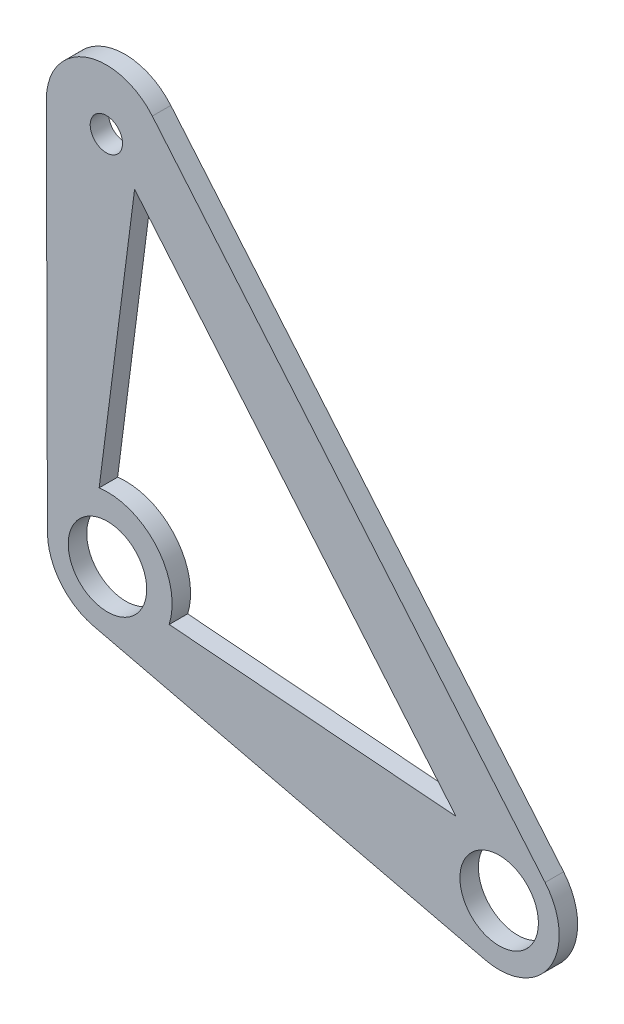
ISO-10303-21;
HEADER;
FILE_DESCRIPTION(('STEP AP214'),'2;1');
FILE_NAME('part.step','',(''),(''),'','','');
FILE_SCHEMA(('AUTOMOTIVE_DESIGN { 1 0 10303 214 1 1 1 1 }'));
ENDSEC;
DATA;
#1=APPLICATION_CONTEXT('core data for automotive mechanical design processes');
#2=APPLICATION_PROTOCOL_DEFINITION('international standard','automotive_design',2000,#1);
#3=PRODUCT_CONTEXT('',#1,'mechanical');
#4=PRODUCT('Part','Part','',(#3));
#5=PRODUCT_RELATED_PRODUCT_CATEGORY('part','',(#4));
#6=PRODUCT_DEFINITION_FORMATION('','',#4);
#7=PRODUCT_DEFINITION_CONTEXT('part definition',#1,'design');
#8=PRODUCT_DEFINITION('design','',#6,#7);
#9=PRODUCT_DEFINITION_SHAPE('','',#8);
#10=(LENGTH_UNIT() NAMED_UNIT(*) SI_UNIT(.MILLI.,.METRE.));
#11=(NAMED_UNIT(*) PLANE_ANGLE_UNIT() SI_UNIT($,.RADIAN.));
#12=(NAMED_UNIT(*) SI_UNIT($,.STERADIAN.) SOLID_ANGLE_UNIT());
#13=UNCERTAINTY_MEASURE_WITH_UNIT(LENGTH_MEASURE(1.E-05),#10,'distance_accuracy_value','');
#14=(GEOMETRIC_REPRESENTATION_CONTEXT(3) GLOBAL_UNCERTAINTY_ASSIGNED_CONTEXT((#13)) GLOBAL_UNIT_ASSIGNED_CONTEXT((#10,
#11,#12)) REPRESENTATION_CONTEXT('',''));
#15=CARTESIAN_POINT('',(0.,0.,0.));
#16=DIRECTION('',(0.,0.,1.));
#17=DIRECTION('',(1.,0.,0.));
#18=AXIS2_PLACEMENT_3D('',#15,#16,#17);
#19=CARTESIAN_POINT('',(-1.50556471431147,-6.32323294612971,2.));
#20=DIRECTION('',(0.231625340663302,0.97280506863534,0.));
#21=DIRECTION('',(-0.97280506863534,0.231625340663302,0.));
#22=AXIS2_PLACEMENT_3D('',#19,#20,#21);
#23=PLANE('',#22);
#24=DIRECTION('',(0.97280506863534,-0.231625340663302,0.));
#25=VECTOR('',#24,1.);
#26=CARTESIAN_POINT('',(-1.50556471431147,-6.32323294612971,0.));
#27=LINE('',#26,#25);
#28=CARTESIAN_POINT('',(-1.50556471431147,-6.32323294612971,0.));
#29=VERTEX_POINT('',#28);
#30=CARTESIAN_POINT('',(40.9087362781894,-16.4220977990497,0.));
#31=VERTEX_POINT('',#30);
#32=EDGE_CURVE('E143',#29,#31,#27,.T.);
#33=ORIENTED_EDGE('',*,*,#32,.T.);
#34=DIRECTION('',(0.,0.,-1.));
#35=VECTOR('',#34,1.);
#36=CARTESIAN_POINT('',(40.9087362781894,-16.4220977990497,2.));
#37=LINE('',#36,#35);
#38=CARTESIAN_POINT('',(40.9087362781894,-16.4220977990497,2.));
#39=VERTEX_POINT('',#38);
#40=EDGE_CURVE('E11',#39,#31,#37,.T.);
#41=ORIENTED_EDGE('',*,*,#40,.F.);
#42=DIRECTION('',(0.97280506863534,-0.231625340663302,0.));
#43=VECTOR('',#42,1.);
#44=CARTESIAN_POINT('',(-1.50556471431147,-6.32323294612971,2.));
#45=LINE('',#44,#43);
#46=CARTESIAN_POINT('',(-1.50556471431147,-6.32323294612971,2.));
#47=VERTEX_POINT('',#46);
#48=EDGE_CURVE('E164',#47,#39,#45,.T.);
#49=ORIENTED_EDGE('',*,*,#48,.F.);
#50=DIRECTION('',(0.,0.,-1.));
#51=VECTOR('',#50,1.);
#52=CARTESIAN_POINT('',(-1.50556471431147,-6.32323294612971,2.));
#53=LINE('',#52,#51);
#54=EDGE_CURVE('E197',#47,#29,#53,.T.);
#55=ORIENTED_EDGE('',*,*,#54,.T.);
#56=EDGE_LOOP('',(#33,#41,#49,#55));
#57=FACE_BOUND('',#56,.T.);
#58=ADVANCED_FACE('F41',(#57),#23,.F.);
#59=CARTESIAN_POINT('',(42.4143009925008,-10.09886485292,2.));
#60=DIRECTION('',(0.,0.,-1.));
#61=DIRECTION('',(-1.,0.,0.));
#62=AXIS2_PLACEMENT_3D('',#59,#60,#61);
#63=CYLINDRICAL_SURFACE('',#62,6.5);
#64=CARTESIAN_POINT('',(42.4143009925008,-10.09886485292,0.));
#65=DIRECTION('',(0.,0.,1.));
#66=DIRECTION('',(1.,0.,0.));
#67=AXIS2_PLACEMENT_3D('',#64,#65,#66);
#68=CIRCLE('',#67,6.5);
#69=CARTESIAN_POINT('',(47.3899667623732,-5.91643133324272,0.));
#70=VERTEX_POINT('',#69);
#71=EDGE_CURVE('E148',#31,#70,#68,.T.);
#72=ORIENTED_EDGE('',*,*,#71,.T.);
#73=DIRECTION('',(0.,0.,-1.));
#74=VECTOR('',#73,1.);
#75=CARTESIAN_POINT('',(47.3899667623732,-5.91643133324272,2.));
#76=LINE('',#75,#74);
#77=CARTESIAN_POINT('',(47.3899667623732,-5.91643133324272,2.));
#78=VERTEX_POINT('',#77);
#79=EDGE_CURVE('E49',#78,#70,#76,.T.);
#80=ORIENTED_EDGE('',*,*,#79,.F.);
#81=CARTESIAN_POINT('',(42.4143009925008,-10.09886485292,2.));
#82=DIRECTION('',(0.,0.,1.));
#83=DIRECTION('',(1.,0.,0.));
#84=AXIS2_PLACEMENT_3D('',#81,#82,#83);
#85=CIRCLE('',#84,6.5);
#86=EDGE_CURVE('E168',#39,#78,#85,.T.);
#87=ORIENTED_EDGE('',*,*,#86,.F.);
#88=ORIENTED_EDGE('',*,*,#40,.T.);
#89=EDGE_LOOP('',(#72,#80,#87,#88));
#90=FACE_BOUND('',#89,.T.);
#91=ADVANCED_FACE('F246',(#90),#63,.T.);
#92=CARTESIAN_POINT('',(24.8549584981767,20.892523003133,2.));
#93=DIRECTION('',(0.765487041518834,0.643451310719578,0.));
#94=DIRECTION('',(-0.643451310719578,0.765487041518834,0.));
#95=AXIS2_PLACEMENT_3D('',#92,#93,#94);
#96=PLANE('',#95);
#97=DIRECTION('',(0.643451310719578,-0.765487041518834,0.));
#98=VECTOR('',#97,1.);
#99=CARTESIAN_POINT('',(24.8549584981767,20.892523003133,0.));
#100=LINE('',#99,#98);
#101=CARTESIAN_POINT('',(4.85783512380911,44.6822621111522,0.));
#102=VERTEX_POINT('',#101);
#103=EDGE_CURVE('E202',#102,#70,#100,.T.);
#104=ORIENTED_EDGE('',*,*,#103,.F.);
#105=DIRECTION('',(0.,0.,-1.));
#106=VECTOR('',#105,1.);
#107=CARTESIAN_POINT('',(4.85783512380911,44.6822621111522,2.));
#108=LINE('',#107,#106);
#109=CARTESIAN_POINT('',(4.85783512380911,44.6822621111522,2.));
#110=VERTEX_POINT('',#109);
#111=EDGE_CURVE('E237',#110,#102,#108,.T.);
#112=ORIENTED_EDGE('',*,*,#111,.F.);
#113=DIRECTION('',(0.643451310719578,-0.765487041518834,0.));
#114=VECTOR('',#113,1.);
#115=CARTESIAN_POINT('',(24.8549584981767,20.892523003133,2.));
#116=LINE('',#115,#114);
#117=EDGE_CURVE('E172',#110,#78,#116,.T.);
#118=ORIENTED_EDGE('',*,*,#117,.T.);
#119=ORIENTED_EDGE('',*,*,#79,.T.);
#120=EDGE_LOOP('',(#104,#112,#118,#119));
#121=FACE_BOUND('',#120,.T.);
#122=ADVANCED_FACE('F243',(#121),#96,.T.);
#123=CARTESIAN_POINT('',(-0.117830646063303,40.4998285914749,2.));
#124=DIRECTION('',(0.,0.,-1.));
#125=DIRECTION('',(-1.,0.,0.));
#126=AXIS2_PLACEMENT_3D('',#123,#124,#125);
#127=CYLINDRICAL_SURFACE('',#126,6.5);
#128=CARTESIAN_POINT('',(-0.117830646063303,40.4998285914749,0.));
#129=DIRECTION('',(0.,0.,1.));
#130=DIRECTION('',(1.,0.,0.));
#131=AXIS2_PLACEMENT_3D('',#128,#129,#130);
#132=CIRCLE('',#131,6.5);
#133=CARTESIAN_POINT('',(-6.6178031360531,40.4809175001314,0.));
#134=VERTEX_POINT('',#133);
#135=EDGE_CURVE('E206',#102,#134,#132,.T.);
#136=ORIENTED_EDGE('',*,*,#135,.T.);
#137=DIRECTION('',(0.,0.,-1.));
#138=VECTOR('',#137,1.);
#139=CARTESIAN_POINT('',(-6.6178031360531,40.4809175001314,2.));
#140=LINE('',#139,#138);
#141=CARTESIAN_POINT('',(-6.6178031360531,40.4809175001314,2.));
#142=VERTEX_POINT('',#141);
#143=EDGE_CURVE('E234',#142,#134,#140,.T.);
#144=ORIENTED_EDGE('',*,*,#143,.F.);
#145=CARTESIAN_POINT('',(-0.117830646063303,40.4998285914749,2.));
#146=DIRECTION('',(0.,0.,1.));
#147=DIRECTION('',(1.,0.,0.));
#148=AXIS2_PLACEMENT_3D('',#145,#146,#147);
#149=CIRCLE('',#148,6.5);
#150=EDGE_CURVE('E176',#110,#142,#149,.T.);
#151=ORIENTED_EDGE('',*,*,#150,.F.);
#152=ORIENTED_EDGE('',*,*,#111,.T.);
#153=EDGE_LOOP('',(#136,#144,#151,#152));
#154=FACE_BOUND('',#153,.T.);
#155=ADVANCED_FACE('F257',(#154),#127,.T.);
#156=CARTESIAN_POINT('',(-6.4999724899898,-0.0189110913434936,2.));
#157=DIRECTION('',(-0.999995767690739,-0.00290939866822979,0.));
#158=DIRECTION('',(0.00290939866822979,-0.999995767690739,0.));
#159=AXIS2_PLACEMENT_3D('',#156,#157,#158);
#160=PLANE('',#159);
#161=DIRECTION('',(-0.00290939866822979,0.999995767690739,0.));
#162=VECTOR('',#161,1.);
#163=CARTESIAN_POINT('',(-6.4999724899898,-0.0189110913434936,0.));
#164=LINE('',#163,#162);
#165=CARTESIAN_POINT('',(-6.4999724899898,-0.0189110913434936,0.));
#166=VERTEX_POINT('',#165);
#167=EDGE_CURVE('E210',#166,#134,#164,.T.);
#168=ORIENTED_EDGE('',*,*,#167,.F.);
#169=DIRECTION('',(0.,0.,-1.));
#170=VECTOR('',#169,1.);
#171=CARTESIAN_POINT('',(-6.4999724899898,-0.0189110913434936,2.));
#172=LINE('',#171,#170);
#173=CARTESIAN_POINT('',(-6.4999724899898,-0.0189110913434936,2.));
#174=VERTEX_POINT('',#173);
#175=EDGE_CURVE('E231',#174,#166,#172,.T.);
#176=ORIENTED_EDGE('',*,*,#175,.F.);
#177=DIRECTION('',(-0.00290939866822979,0.999995767690739,0.));
#178=VECTOR('',#177,1.);
#179=CARTESIAN_POINT('',(-6.4999724899898,-0.0189110913434936,2.));
#180=LINE('',#179,#178);
#181=EDGE_CURVE('E179',#174,#142,#180,.T.);
#182=ORIENTED_EDGE('',*,*,#181,.T.);
#183=ORIENTED_EDGE('',*,*,#143,.T.);
#184=EDGE_LOOP('',(#168,#176,#182,#183));
#185=FACE_BOUND('',#184,.T.);
#186=ADVANCED_FACE('F267',(#185),#160,.T.);
#187=CARTESIAN_POINT('',(-0.117830646063303,40.4998285914749,2.));
#188=DIRECTION('',(0.,0.,-1.));
#189=DIRECTION('',(-1.,0.,0.));
#190=AXIS2_PLACEMENT_3D('',#187,#188,#189);
#191=CYLINDRICAL_SURFACE('',#190,1.75);
#192=CARTESIAN_POINT('',(-0.117830646063303,40.4998285914749,2.));
#193=DIRECTION('',(0.,0.,1.));
#194=DIRECTION('',(1.,0.,0.));
#195=AXIS2_PLACEMENT_3D('',#192,#193,#194);
#196=CIRCLE('',#195,1.75);
#197=CARTESIAN_POINT('',(1.6321693539367,40.4998285914749,2.));
#198=VERTEX_POINT('',#197);
#199=EDGE_CURVE('E190',#198,#198,#196,.T.);
#200=ORIENTED_EDGE('',*,*,#199,.T.);
#201=EDGE_LOOP('',(#200));
#202=FACE_BOUND('',#201,.T.);
#203=CARTESIAN_POINT('',(-0.117830646063303,40.4998285914749,0.));
#204=DIRECTION('',(0.,0.,1.));
#205=DIRECTION('',(1.,0.,0.));
#206=AXIS2_PLACEMENT_3D('',#203,#204,#205);
#207=CIRCLE('',#206,1.75);
#208=CARTESIAN_POINT('',(1.6321693539367,40.4998285914749,0.));
#209=VERTEX_POINT('',#208);
#210=EDGE_CURVE('E221',#209,#209,#207,.T.);
#211=ORIENTED_EDGE('',*,*,#210,.F.);
#212=EDGE_LOOP('',(#211));
#213=FACE_BOUND('',#212,.T.);
#214=ADVANCED_FACE('F279',(#202,#213),#191,.F.);
#215=CARTESIAN_POINT('',(0.,0.,2.));
#216=DIRECTION('',(0.,0.,-1.));
#217=DIRECTION('',(-1.,0.,0.));
#218=AXIS2_PLACEMENT_3D('',#215,#216,#217);
#219=CYLINDRICAL_SURFACE('',#218,4.25);
#220=CARTESIAN_POINT('',(0.,0.,2.));
#221=DIRECTION('',(0.,0.,1.));
#222=DIRECTION('',(1.,0.,0.));
#223=AXIS2_PLACEMENT_3D('',#220,#221,#222);
#224=CIRCLE('',#223,4.25);
#225=CARTESIAN_POINT('',(4.25,0.,2.));
#226=VERTEX_POINT('',#225);
#227=EDGE_CURVE('E186',#226,#226,#224,.T.);
#228=ORIENTED_EDGE('',*,*,#227,.T.);
#229=EDGE_LOOP('',(#228));
#230=FACE_BOUND('',#229,.T.);
#231=CARTESIAN_POINT('',(0.,0.,0.));
#232=DIRECTION('',(0.,0.,1.));
#233=DIRECTION('',(1.,0.,0.));
#234=AXIS2_PLACEMENT_3D('',#231,#232,#233);
#235=CIRCLE('',#234,4.25);
#236=CARTESIAN_POINT('',(4.25,0.,0.));
#237=VERTEX_POINT('',#236);
#238=EDGE_CURVE('E217',#237,#237,#235,.T.);
#239=ORIENTED_EDGE('',*,*,#238,.F.);
#240=EDGE_LOOP('',(#239));
#241=FACE_BOUND('',#240,.T.);
#242=ADVANCED_FACE('F271',(#230,#241),#219,.F.);
#243=CARTESIAN_POINT('',(0.,0.,2.));
#244=DIRECTION('',(0.,0.,-1.));
#245=DIRECTION('',(-1.,0.,0.));
#246=AXIS2_PLACEMENT_3D('',#243,#244,#245);
#247=CYLINDRICAL_SURFACE('',#246,6.5);
#248=CARTESIAN_POINT('',(0.,0.,0.));
#249=DIRECTION('',(0.,0.,1.));
#250=DIRECTION('',(1.,0.,0.));
#251=AXIS2_PLACEMENT_3D('',#248,#249,#250);
#252=CIRCLE('',#251,6.5);
#253=EDGE_CURVE('E214',#166,#29,#252,.T.);
#254=ORIENTED_EDGE('',*,*,#253,.T.);
#255=ORIENTED_EDGE('',*,*,#54,.F.);
#256=CARTESIAN_POINT('',(0.,0.,2.));
#257=DIRECTION('',(0.,0.,1.));
#258=DIRECTION('',(1.,0.,0.));
#259=AXIS2_PLACEMENT_3D('',#256,#257,#258);
#260=CIRCLE('',#259,6.5);
#261=EDGE_CURVE('E183',#174,#47,#260,.T.);
#262=ORIENTED_EDGE('',*,*,#261,.F.);
#263=ORIENTED_EDGE('',*,*,#175,.T.);
#264=EDGE_LOOP('',(#254,#255,#262,#263));
#265=FACE_BOUND('',#264,.T.);
#266=ADVANCED_FACE('F268',(#265),#247,.T.);
#267=CARTESIAN_POINT('',(42.4143009925008,-10.09886485292,2.));
#268=DIRECTION('',(0.,0.,-1.));
#269=DIRECTION('',(-1.,0.,0.));
#270=AXIS2_PLACEMENT_3D('',#267,#268,#269);
#271=CYLINDRICAL_SURFACE('',#270,4.25000000000001);
#272=CARTESIAN_POINT('',(42.4143009925008,-10.09886485292,2.));
#273=DIRECTION('',(0.,0.,1.));
#274=DIRECTION('',(1.,0.,0.));
#275=AXIS2_PLACEMENT_3D('',#272,#273,#274);
#276=CIRCLE('',#275,4.25000000000001);
#277=CARTESIAN_POINT('',(46.6643009925008,-10.09886485292,2.));
#278=VERTEX_POINT('',#277);
#279=EDGE_CURVE('E194',#278,#278,#276,.T.);
#280=ORIENTED_EDGE('',*,*,#279,.T.);
#281=EDGE_LOOP('',(#280));
#282=FACE_BOUND('',#281,.T.);
#283=CARTESIAN_POINT('',(42.4143009925008,-10.09886485292,0.));
#284=DIRECTION('',(0.,0.,1.));
#285=DIRECTION('',(1.,0.,0.));
#286=AXIS2_PLACEMENT_3D('',#283,#284,#285);
#287=CIRCLE('',#286,4.25000000000001);
#288=CARTESIAN_POINT('',(46.6643009925008,-10.09886485292,0.));
#289=VERTEX_POINT('',#288);
#290=EDGE_CURVE('E169',#289,#289,#287,.T.);
#291=ORIENTED_EDGE('',*,*,#290,.F.);
#292=EDGE_LOOP('',(#291));
#293=FACE_BOUND('',#292,.T.);
#294=ADVANCED_FACE('F270',(#282,#293),#271,.F.);
#295=CARTESIAN_POINT('',(0.,0.,2.));
#296=DIRECTION('',(0.,0.,1.));
#297=DIRECTION('',(1.,0.,0.));
#298=AXIS2_PLACEMENT_3D('',#295,#296,#297);
#299=PLANE('',#298);
#300=DIRECTION('',(0.996856049885564,-0.079233930904309,0.));
#301=VECTOR('',#300,1.);
#302=CARTESIAN_POINT('',(6.68386670088338,-2.0798860364987,2.));
#303=LINE('',#302,#301);
#304=CARTESIAN_POINT('',(6.68386670088338,-2.0798860364987,2.));
#305=VERTEX_POINT('',#304);
#306=CARTESIAN_POINT('',(37.7492789897839,-4.54908380190844,2.));
#307=VERTEX_POINT('',#306);
#308=EDGE_CURVE('E56',#305,#307,#303,.T.);
#309=ORIENTED_EDGE('',*,*,#308,.F.);
#310=CARTESIAN_POINT('',(0.,0.,2.));
#311=DIRECTION('',(0.,0.,1.));
#312=DIRECTION('',(1.,0.,0.));
#313=AXIS2_PLACEMENT_3D('',#310,#311,#312);
#314=CIRCLE('',#313,7.);
#315=CARTESIAN_POINT('',(-0.899681345851854,6.94194306199109,2.));
#316=VERTEX_POINT('',#315);
#317=EDGE_CURVE('E129',#305,#316,#314,.T.);
#318=ORIENTED_EDGE('',*,*,#317,.T.);
#319=DIRECTION('',(-0.127233239163485,-0.991872825946939,0.));
#320=VECTOR('',#319,1.);
#321=CARTESIAN_POINT('',(2.93856307985469,36.8637651442604,2.));
#322=LINE('',#321,#320);
#323=CARTESIAN_POINT('',(2.93856307985469,36.8637651442604,2.));
#324=VERTEX_POINT('',#323);
#325=EDGE_CURVE('E135',#324,#316,#322,.T.);
#326=ORIENTED_EDGE('',*,*,#325,.F.);
#327=DIRECTION('',(0.643451310719579,-0.765487041518834,0.));
#328=VECTOR('',#327,1.);
#329=CARTESIAN_POINT('',(2.93856307985469,36.8637651442604,2.));
#330=LINE('',#329,#328);
#331=EDGE_CURVE('E141',#324,#307,#330,.T.);
#332=ORIENTED_EDGE('',*,*,#331,.T.);
#333=EDGE_LOOP('',(#309,#318,#326,#332));
#334=FACE_BOUND('',#333,.T.);
#335=ORIENTED_EDGE('',*,*,#48,.T.);
#336=ORIENTED_EDGE('',*,*,#86,.T.);
#337=ORIENTED_EDGE('',*,*,#117,.F.);
#338=ORIENTED_EDGE('',*,*,#150,.T.);
#339=ORIENTED_EDGE('',*,*,#181,.F.);
#340=ORIENTED_EDGE('',*,*,#261,.T.);
#341=EDGE_LOOP('',(#335,#336,#337,#338,#339,#340));
#342=FACE_BOUND('',#341,.T.);
#343=ORIENTED_EDGE('',*,*,#227,.F.);
#344=EDGE_LOOP('',(#343));
#345=FACE_BOUND('',#344,.T.);
#346=ORIENTED_EDGE('',*,*,#199,.F.);
#347=EDGE_LOOP('',(#346));
#348=FACE_BOUND('',#347,.T.);
#349=ORIENTED_EDGE('',*,*,#279,.F.);
#350=EDGE_LOOP('',(#349));
#351=FACE_BOUND('',#350,.T.);
#352=ADVANCED_FACE('F138',(#334,#342,#345,#348,#351),#299,.T.);
#353=CARTESIAN_POINT('',(0.,0.,0.));
#354=DIRECTION('',(0.,0.,1.));
#355=DIRECTION('',(1.,0.,0.));
#356=AXIS2_PLACEMENT_3D('',#353,#354,#355);
#357=PLANE('',#356);
#358=CARTESIAN_POINT('',(0.,0.,0.));
#359=DIRECTION('',(0.,0.,1.));
#360=DIRECTION('',(1.,0.,0.));
#361=AXIS2_PLACEMENT_3D('',#358,#359,#360);
#362=CIRCLE('',#361,7.);
#363=CARTESIAN_POINT('',(6.68386670088338,-2.0798860364987,0.));
#364=VERTEX_POINT('',#363);
#365=CARTESIAN_POINT('',(-0.899681345851854,6.94194306199109,0.));
#366=VERTEX_POINT('',#365);
#367=EDGE_CURVE('E153',#364,#366,#362,.T.);
#368=ORIENTED_EDGE('',*,*,#367,.F.);
#369=DIRECTION('',(0.996856049885564,-0.079233930904309,0.));
#370=VECTOR('',#369,1.);
#371=CARTESIAN_POINT('',(6.68386670088338,-2.0798860364987,0.));
#372=LINE('',#371,#370);
#373=CARTESIAN_POINT('',(37.7492789897839,-4.54908380190844,0.));
#374=VERTEX_POINT('',#373);
#375=EDGE_CURVE('E122',#364,#374,#372,.T.);
#376=ORIENTED_EDGE('',*,*,#375,.T.);
#377=DIRECTION('',(0.643451310719579,-0.765487041518834,0.));
#378=VECTOR('',#377,1.);
#379=CARTESIAN_POINT('',(2.93856307985469,36.8637651442604,0.));
#380=LINE('',#379,#378);
#381=CARTESIAN_POINT('',(2.93856307985469,36.8637651442605,0.));
#382=VERTEX_POINT('',#381);
#383=EDGE_CURVE('E159',#382,#374,#380,.T.);
#384=ORIENTED_EDGE('',*,*,#383,.F.);
#385=DIRECTION('',(-0.127233239163485,-0.991872825946939,0.));
#386=VECTOR('',#385,1.);
#387=CARTESIAN_POINT('',(2.93856307985469,36.8637651442604,0.));
#388=LINE('',#387,#386);
#389=EDGE_CURVE('E64',#382,#366,#388,.T.);
#390=ORIENTED_EDGE('',*,*,#389,.T.);
#391=EDGE_LOOP('',(#368,#376,#384,#390));
#392=FACE_BOUND('',#391,.T.);
#393=ORIENTED_EDGE('',*,*,#32,.F.);
#394=ORIENTED_EDGE('',*,*,#253,.F.);
#395=ORIENTED_EDGE('',*,*,#167,.T.);
#396=ORIENTED_EDGE('',*,*,#135,.F.);
#397=ORIENTED_EDGE('',*,*,#103,.T.);
#398=ORIENTED_EDGE('',*,*,#71,.F.);
#399=EDGE_LOOP('',(#393,#394,#395,#396,#397,#398));
#400=FACE_BOUND('',#399,.T.);
#401=ORIENTED_EDGE('',*,*,#238,.T.);
#402=EDGE_LOOP('',(#401));
#403=FACE_BOUND('',#402,.T.);
#404=ORIENTED_EDGE('',*,*,#210,.T.);
#405=EDGE_LOOP('',(#404));
#406=FACE_BOUND('',#405,.T.);
#407=ORIENTED_EDGE('',*,*,#290,.T.);
#408=EDGE_LOOP('',(#407));
#409=FACE_BOUND('',#408,.T.);
#410=ADVANCED_FACE('F251',(#392,#400,#403,#406,#409),#357,.F.);
#411=CARTESIAN_POINT('',(6.68386670088338,-2.0798860364987,0.));
#412=DIRECTION('',(-0.0792339309043091,-0.996856049885565,0.));
#413=DIRECTION('',(0.996856049885565,-0.0792339309043091,0.));
#414=AXIS2_PLACEMENT_3D('',#411,#412,#413);
#415=PLANE('',#414);
#416=ORIENTED_EDGE('',*,*,#308,.T.);
#417=DIRECTION('',(0.,0.,1.));
#418=VECTOR('',#417,1.);
#419=CARTESIAN_POINT('',(37.7492789897839,-4.54908380190844,0.));
#420=LINE('',#419,#418);
#421=EDGE_CURVE('E156',#374,#307,#420,.T.);
#422=ORIENTED_EDGE('',*,*,#421,.F.);
#423=ORIENTED_EDGE('',*,*,#375,.F.);
#424=DIRECTION('',(0.,0.,1.));
#425=VECTOR('',#424,1.);
#426=CARTESIAN_POINT('',(6.68386670088338,-2.0798860364987,0.));
#427=LINE('',#426,#425);
#428=EDGE_CURVE('E118',#364,#305,#427,.T.);
#429=ORIENTED_EDGE('',*,*,#428,.T.);
#430=EDGE_LOOP('',(#416,#422,#423,#429));
#431=FACE_BOUND('',#430,.T.);
#432=ADVANCED_FACE('F120',(#431),#415,.F.);
#433=CARTESIAN_POINT('',(0.,0.,0.));
#434=DIRECTION('',(0.,0.,1.));
#435=DIRECTION('',(1.,0.,0.));
#436=AXIS2_PLACEMENT_3D('',#433,#434,#435);
#437=CYLINDRICAL_SURFACE('',#436,7.);
#438=ORIENTED_EDGE('',*,*,#317,.F.);
#439=ORIENTED_EDGE('',*,*,#428,.F.);
#440=ORIENTED_EDGE('',*,*,#367,.T.);
#441=DIRECTION('',(0.,0.,1.));
#442=VECTOR('',#441,1.);
#443=CARTESIAN_POINT('',(-0.899681345851854,6.94194306199109,0.));
#444=LINE('',#443,#442);
#445=EDGE_CURVE('E126',#366,#316,#444,.T.);
#446=ORIENTED_EDGE('',*,*,#445,.T.);
#447=EDGE_LOOP('',(#438,#439,#440,#446));
#448=FACE_BOUND('',#447,.T.);
#449=ADVANCED_FACE('F130',(#448),#437,.T.);
#450=CARTESIAN_POINT('',(2.93856307985469,36.8637651442604,0.));
#451=DIRECTION('',(-0.991872825946939,0.127233239163485,0.));
#452=DIRECTION('',(-0.127233239163485,-0.991872825946939,0.));
#453=AXIS2_PLACEMENT_3D('',#450,#451,#452);
#454=PLANE('',#453);
#455=ORIENTED_EDGE('',*,*,#325,.T.);
#456=ORIENTED_EDGE('',*,*,#445,.F.);
#457=ORIENTED_EDGE('',*,*,#389,.F.);
#458=DIRECTION('',(0.,0.,1.));
#459=VECTOR('',#458,1.);
#460=CARTESIAN_POINT('',(2.93856307985469,36.8637651442604,0.));
#461=LINE('',#460,#459);
#462=EDGE_CURVE('E422',#382,#324,#461,.T.);
#463=ORIENTED_EDGE('',*,*,#462,.T.);
#464=EDGE_LOOP('',(#455,#456,#457,#463));
#465=FACE_BOUND('',#464,.T.);
#466=ADVANCED_FACE('F310',(#465),#454,.F.);
#467=CARTESIAN_POINT('',(2.93856307985469,36.8637651442604,0.));
#468=DIRECTION('',(-0.765487041518834,-0.643451310719579,0.));
#469=DIRECTION('',(0.643451310719579,-0.765487041518834,0.));
#470=AXIS2_PLACEMENT_3D('',#467,#468,#469);
#471=PLANE('',#470);
#472=ORIENTED_EDGE('',*,*,#331,.F.);
#473=ORIENTED_EDGE('',*,*,#462,.F.);
#474=ORIENTED_EDGE('',*,*,#383,.T.);
#475=ORIENTED_EDGE('',*,*,#421,.T.);
#476=EDGE_LOOP('',(#472,#473,#474,#475));
#477=FACE_BOUND('',#476,.T.);
#478=ADVANCED_FACE('F313',(#477),#471,.T.);
#479=CLOSED_SHELL('',(#58,#91,#122,#155,#186,#214,#242,#266,#294,#352,#410,#432,#449,#466,#478));
#480=MANIFOLD_SOLID_BREP('B2',#479);
#481=ADVANCED_BREP_SHAPE_REPRESENTATION('',(#18,#480),#14);
#482=SHAPE_DEFINITION_REPRESENTATION(#9,#481);
ENDSEC;
END-ISO-10303-21;
